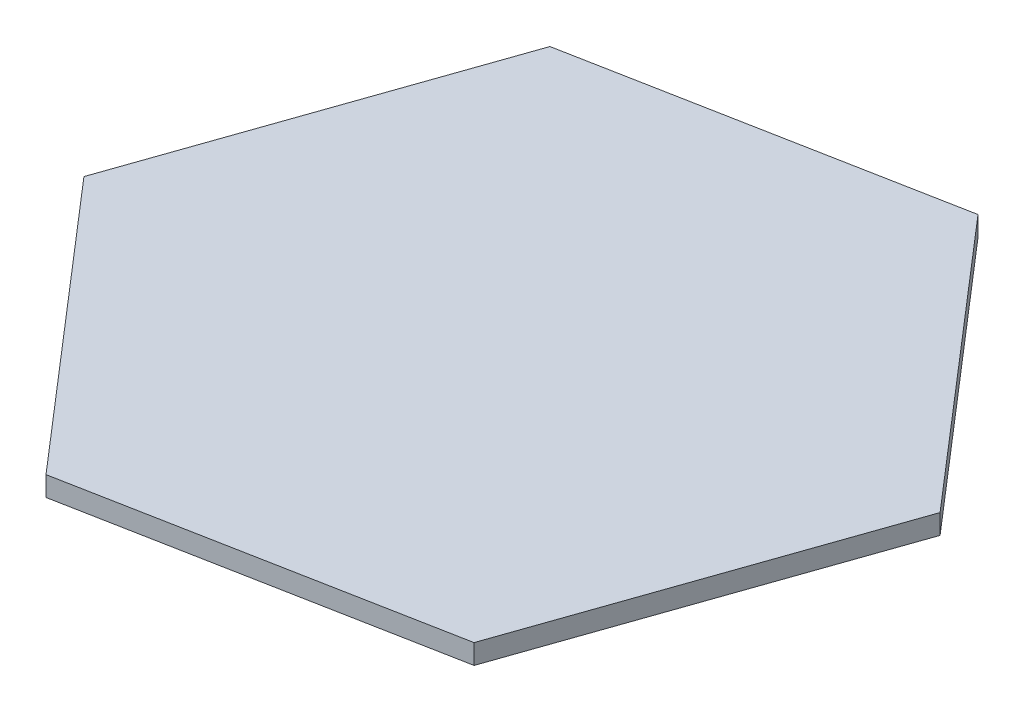
ISO-10303-21;
HEADER;
FILE_DESCRIPTION(('STEP AP214'),'2;1');
FILE_NAME('part.step','',(''),(''),'','','');
FILE_SCHEMA(('AUTOMOTIVE_DESIGN { 1 0 10303 214 1 1 1 1 }'));
ENDSEC;
DATA;
#1=APPLICATION_CONTEXT('core data for automotive mechanical design processes');
#2=APPLICATION_PROTOCOL_DEFINITION('international standard','automotive_design',2000,#1);
#3=PRODUCT_CONTEXT('',#1,'mechanical');
#4=PRODUCT('Part','Part','',(#3));
#5=PRODUCT_RELATED_PRODUCT_CATEGORY('part','',(#4));
#6=PRODUCT_DEFINITION_FORMATION('','',#4);
#7=PRODUCT_DEFINITION_CONTEXT('part definition',#1,'design');
#8=PRODUCT_DEFINITION('design','',#6,#7);
#9=PRODUCT_DEFINITION_SHAPE('','',#8);
#10=(LENGTH_UNIT() NAMED_UNIT(*) SI_UNIT(.MILLI.,.METRE.));
#11=(NAMED_UNIT(*) PLANE_ANGLE_UNIT() SI_UNIT($,.RADIAN.));
#12=(NAMED_UNIT(*) SI_UNIT($,.STERADIAN.) SOLID_ANGLE_UNIT());
#13=UNCERTAINTY_MEASURE_WITH_UNIT(LENGTH_MEASURE(1.E-05),#10,'distance_accuracy_value','');
#14=(GEOMETRIC_REPRESENTATION_CONTEXT(3) GLOBAL_UNCERTAINTY_ASSIGNED_CONTEXT((#13)) GLOBAL_UNIT_ASSIGNED_CONTEXT((#10,
#11,#12)) REPRESENTATION_CONTEXT('',''));
#15=CARTESIAN_POINT('',(0.,0.,0.));
#16=DIRECTION('',(0.,0.,1.));
#17=DIRECTION('',(1.,0.,0.));
#18=AXIS2_PLACEMENT_3D('',#15,#16,#17);
#19=CARTESIAN_POINT('',(-60.7644290860522,10.,174.471334774072));
#20=DIRECTION('',(-0.187345754544284,0.,-0.982294033502308));
#21=DIRECTION('',(-0.982294033502308,0.,0.187345754544284));
#22=AXIS2_PLACEMENT_3D('',#19,#20,#21);
#23=PLANE('',#22);
#24=DIRECTION('',(0.982294033502308,0.,-0.187345754544284));
#25=VECTOR('',#24,1.);
#26=CARTESIAN_POINT('',(-60.7644290860522,0.,174.471334774072));
#27=LINE('',#26,#25);
#28=CARTESIAN_POINT('',(-60.7644290860522,0.,174.471334774072));
#29=VERTEX_POINT('',#28);
#30=CARTESIAN_POINT('',(120.714393603499,0.,139.859206622015));
#31=VERTEX_POINT('',#30);
#32=EDGE_CURVE('E117',#29,#31,#27,.T.);
#33=ORIENTED_EDGE('',*,*,#32,.T.);
#34=DIRECTION('',(0.,-1.,0.));
#35=VECTOR('',#34,1.);
#36=CARTESIAN_POINT('',(120.714393603499,10.,139.859206622015));
#37=LINE('',#36,#35);
#38=CARTESIAN_POINT('',(120.714393603499,10.,139.859206622015));
#39=VERTEX_POINT('',#38);
#40=EDGE_CURVE('E11',#39,#31,#37,.T.);
#41=ORIENTED_EDGE('',*,*,#40,.F.);
#42=DIRECTION('',(0.982294033502308,0.,-0.187345754544284));
#43=VECTOR('',#42,1.);
#44=CARTESIAN_POINT('',(-60.7644290860522,10.,174.471334774072));
#45=LINE('',#44,#43);
#46=CARTESIAN_POINT('',(-60.7644290860522,10.,174.471334774072));
#47=VERTEX_POINT('',#46);
#48=EDGE_CURVE('E127',#47,#39,#45,.T.);
#49=ORIENTED_EDGE('',*,*,#48,.F.);
#50=DIRECTION('',(0.,-1.,0.));
#51=VECTOR('',#50,1.);
#52=CARTESIAN_POINT('',(-60.7644290860522,10.,174.471334774072));
#53=LINE('',#52,#51);
#54=EDGE_CURVE('E113',#47,#29,#53,.T.);
#55=ORIENTED_EDGE('',*,*,#54,.T.);
#56=EDGE_LOOP('',(#33,#41,#49,#55));
#57=FACE_BOUND('',#56,.T.);
#58=ADVANCED_FACE('F33',(#57),#23,.F.);
#59=CARTESIAN_POINT('',(120.714393603499,10.,139.859206622015));
#60=DIRECTION('',(-0.944364464271023,0.,-0.32890083402464));
#61=DIRECTION('',(-0.32890083402464,0.,0.944364464271023));
#62=AXIS2_PLACEMENT_3D('',#59,#60,#61);
#63=PLANE('',#62);
#64=DIRECTION('',(0.32890083402464,0.,-0.944364464271023));
#65=VECTOR('',#64,1.);
#66=CARTESIAN_POINT('',(120.714393603499,0.,139.859206622015));
#67=LINE('',#66,#65);
#68=CARTESIAN_POINT('',(181.478822689551,0.,-34.6121281520565));
#69=VERTEX_POINT('',#68);
#70=EDGE_CURVE('E120',#31,#69,#67,.T.);
#71=ORIENTED_EDGE('',*,*,#70,.T.);
#72=DIRECTION('',(0.,-1.,0.));
#73=VECTOR('',#72,1.);
#74=CARTESIAN_POINT('',(181.478822689551,10.,-34.6121281520565));
#75=LINE('',#74,#73);
#76=CARTESIAN_POINT('',(181.478822689551,10.,-34.6121281520565));
#77=VERTEX_POINT('',#76);
#78=EDGE_CURVE('E41',#77,#69,#75,.T.);
#79=ORIENTED_EDGE('',*,*,#78,.F.);
#80=DIRECTION('',(0.32890083402464,0.,-0.944364464271023));
#81=VECTOR('',#80,1.);
#82=CARTESIAN_POINT('',(120.714393603499,10.,139.859206622015));
#83=LINE('',#82,#81);
#84=EDGE_CURVE('E86',#39,#77,#83,.T.);
#85=ORIENTED_EDGE('',*,*,#84,.F.);
#86=ORIENTED_EDGE('',*,*,#40,.T.);
#87=EDGE_LOOP('',(#71,#79,#85,#86));
#88=FACE_BOUND('',#87,.T.);
#89=ADVANCED_FACE('F151',(#88),#63,.F.);
#90=CARTESIAN_POINT('',(181.478822689551,10.,-34.6121281520565));
#91=DIRECTION('',(-0.757018709726739,0.,0.653393199477668));
#92=DIRECTION('',(0.653393199477668,0.,0.757018709726739));
#93=AXIS2_PLACEMENT_3D('',#90,#91,#92);
#94=PLANE('',#93);
#95=DIRECTION('',(-0.653393199477668,0.,-0.757018709726739));
#96=VECTOR('',#95,1.);
#97=CARTESIAN_POINT('',(181.478822689551,0.,-34.6121281520565));
#98=LINE('',#97,#96);
#99=CARTESIAN_POINT('',(60.7644290860523,0.,-174.471334774071));
#100=VERTEX_POINT('',#99);
#101=EDGE_CURVE('E122',#69,#100,#98,.T.);
#102=ORIENTED_EDGE('',*,*,#101,.T.);
#103=DIRECTION('',(0.,-1.,0.));
#104=VECTOR('',#103,1.);
#105=CARTESIAN_POINT('',(60.7644290860523,10.,-174.471334774071));
#106=LINE('',#105,#104);
#107=CARTESIAN_POINT('',(60.7644290860523,10.,-174.471334774071));
#108=VERTEX_POINT('',#107);
#109=EDGE_CURVE('E108',#108,#100,#106,.T.);
#110=ORIENTED_EDGE('',*,*,#109,.F.);
#111=DIRECTION('',(-0.653393199477668,0.,-0.757018709726739));
#112=VECTOR('',#111,1.);
#113=CARTESIAN_POINT('',(181.478822689551,10.,-34.6121281520565));
#114=LINE('',#113,#112);
#115=EDGE_CURVE('E99',#77,#108,#114,.T.);
#116=ORIENTED_EDGE('',*,*,#115,.F.);
#117=ORIENTED_EDGE('',*,*,#78,.T.);
#118=EDGE_LOOP('',(#102,#110,#116,#117));
#119=FACE_BOUND('',#118,.T.);
#120=ADVANCED_FACE('F133',(#119),#94,.F.);
#121=CARTESIAN_POINT('',(60.7644290860523,10.,-174.471334774071));
#122=DIRECTION('',(0.187345754544284,0.,0.982294033502308));
#123=DIRECTION('',(0.982294033502308,0.,-0.187345754544284));
#124=AXIS2_PLACEMENT_3D('',#121,#122,#123);
#125=PLANE('',#124);
#126=DIRECTION('',(-0.982294033502308,0.,0.187345754544284));
#127=VECTOR('',#126,1.);
#128=CARTESIAN_POINT('',(60.7644290860523,0.,-174.471334774071));
#129=LINE('',#128,#127);
#130=CARTESIAN_POINT('',(-120.714393603499,0.,-139.859206622015));
#131=VERTEX_POINT('',#130);
#132=EDGE_CURVE('E107',#100,#131,#129,.T.);
#133=ORIENTED_EDGE('',*,*,#132,.T.);
#134=DIRECTION('',(0.,-1.,0.));
#135=VECTOR('',#134,1.);
#136=CARTESIAN_POINT('',(-120.714393603499,10.,-139.859206622015));
#137=LINE('',#136,#135);
#138=CARTESIAN_POINT('',(-120.714393603499,10.,-139.859206622015));
#139=VERTEX_POINT('',#138);
#140=EDGE_CURVE('E104',#139,#131,#137,.T.);
#141=ORIENTED_EDGE('',*,*,#140,.F.);
#142=DIRECTION('',(-0.982294033502308,0.,0.187345754544284));
#143=VECTOR('',#142,1.);
#144=CARTESIAN_POINT('',(60.7644290860523,10.,-174.471334774071));
#145=LINE('',#144,#143);
#146=EDGE_CURVE('E93',#108,#139,#145,.T.);
#147=ORIENTED_EDGE('',*,*,#146,.F.);
#148=ORIENTED_EDGE('',*,*,#109,.T.);
#149=EDGE_LOOP('',(#133,#141,#147,#148));
#150=FACE_BOUND('',#149,.T.);
#151=ADVANCED_FACE('F105',(#150),#125,.F.);
#152=CARTESIAN_POINT('',(-120.714393603499,10.,-139.859206622015));
#153=DIRECTION('',(0.944364464271023,0.,0.32890083402464));
#154=DIRECTION('',(0.32890083402464,0.,-0.944364464271023));
#155=AXIS2_PLACEMENT_3D('',#152,#153,#154);
#156=PLANE('',#155);
#157=DIRECTION('',(-0.32890083402464,0.,0.944364464271023));
#158=VECTOR('',#157,1.);
#159=CARTESIAN_POINT('',(-120.714393603499,0.,-139.859206622015));
#160=LINE('',#159,#158);
#161=CARTESIAN_POINT('',(-181.478822689551,0.,34.6121281520564));
#162=VERTEX_POINT('',#161);
#163=EDGE_CURVE('E72',#131,#162,#160,.T.);
#164=ORIENTED_EDGE('',*,*,#163,.T.);
#165=DIRECTION('',(0.,-1.,0.));
#166=VECTOR('',#165,1.);
#167=CARTESIAN_POINT('',(-181.478822689551,10.,34.6121281520564));
#168=LINE('',#167,#166);
#169=CARTESIAN_POINT('',(-181.478822689551,10.,34.6121281520564));
#170=VERTEX_POINT('',#169);
#171=EDGE_CURVE('E109',#170,#162,#168,.T.);
#172=ORIENTED_EDGE('',*,*,#171,.F.);
#173=DIRECTION('',(-0.32890083402464,0.,0.944364464271023));
#174=VECTOR('',#173,1.);
#175=CARTESIAN_POINT('',(-120.714393603499,10.,-139.859206622015));
#176=LINE('',#175,#174);
#177=EDGE_CURVE('E97',#139,#170,#176,.T.);
#178=ORIENTED_EDGE('',*,*,#177,.F.);
#179=ORIENTED_EDGE('',*,*,#140,.T.);
#180=EDGE_LOOP('',(#164,#172,#178,#179));
#181=FACE_BOUND('',#180,.T.);
#182=ADVANCED_FACE('F111',(#181),#156,.F.);
#183=CARTESIAN_POINT('',(-181.478822689551,10.,34.6121281520564));
#184=DIRECTION('',(0.757018709726739,0.,-0.653393199477668));
#185=DIRECTION('',(-0.653393199477668,0.,-0.757018709726739));
#186=AXIS2_PLACEMENT_3D('',#183,#184,#185);
#187=PLANE('',#186);
#188=DIRECTION('',(0.653393199477668,0.,0.757018709726739));
#189=VECTOR('',#188,1.);
#190=CARTESIAN_POINT('',(-181.478822689551,0.,34.6121281520564));
#191=LINE('',#190,#189);
#192=EDGE_CURVE('E78',#162,#29,#191,.T.);
#193=ORIENTED_EDGE('',*,*,#192,.T.);
#194=ORIENTED_EDGE('',*,*,#54,.F.);
#195=DIRECTION('',(0.653393199477668,0.,0.757018709726739));
#196=VECTOR('',#195,1.);
#197=CARTESIAN_POINT('',(-181.478822689551,10.,34.6121281520564));
#198=LINE('',#197,#196);
#199=EDGE_CURVE('E49',#170,#47,#198,.T.);
#200=ORIENTED_EDGE('',*,*,#199,.F.);
#201=ORIENTED_EDGE('',*,*,#171,.T.);
#202=EDGE_LOOP('',(#193,#194,#200,#201));
#203=FACE_BOUND('',#202,.T.);
#204=ADVANCED_FACE('F140',(#203),#187,.F.);
#205=CARTESIAN_POINT('',(0.,10.,0.));
#206=DIRECTION('',(0.,1.,0.));
#207=DIRECTION('',(0.,0.,1.));
#208=AXIS2_PLACEMENT_3D('',#205,#206,#207);
#209=PLANE('',#208);
#210=ORIENTED_EDGE('',*,*,#48,.T.);
#211=ORIENTED_EDGE('',*,*,#84,.T.);
#212=ORIENTED_EDGE('',*,*,#115,.T.);
#213=ORIENTED_EDGE('',*,*,#146,.T.);
#214=ORIENTED_EDGE('',*,*,#177,.T.);
#215=ORIENTED_EDGE('',*,*,#199,.T.);
#216=EDGE_LOOP('',(#210,#211,#212,#213,#214,#215));
#217=FACE_BOUND('',#216,.T.);
#218=ADVANCED_FACE('F95',(#217),#209,.T.);
#219=CARTESIAN_POINT('',(0.,0.,0.));
#220=DIRECTION('',(0.,1.,0.));
#221=DIRECTION('',(0.,0.,1.));
#222=AXIS2_PLACEMENT_3D('',#219,#220,#221);
#223=PLANE('',#222);
#224=ORIENTED_EDGE('',*,*,#32,.F.);
#225=ORIENTED_EDGE('',*,*,#192,.F.);
#226=ORIENTED_EDGE('',*,*,#163,.F.);
#227=ORIENTED_EDGE('',*,*,#132,.F.);
#228=ORIENTED_EDGE('',*,*,#101,.F.);
#229=ORIENTED_EDGE('',*,*,#70,.F.);
#230=EDGE_LOOP('',(#224,#225,#226,#227,#228,#229));
#231=FACE_BOUND('',#230,.T.);
#232=ADVANCED_FACE('F136',(#231),#223,.F.);
#233=CLOSED_SHELL('',(#58,#89,#120,#151,#182,#204,#218,#232));
#234=MANIFOLD_SOLID_BREP('B2',#233);
#235=ADVANCED_BREP_SHAPE_REPRESENTATION('',(#18,#234),#14);
#236=SHAPE_DEFINITION_REPRESENTATION(#9,#235);
ENDSEC;
END-ISO-10303-21;
